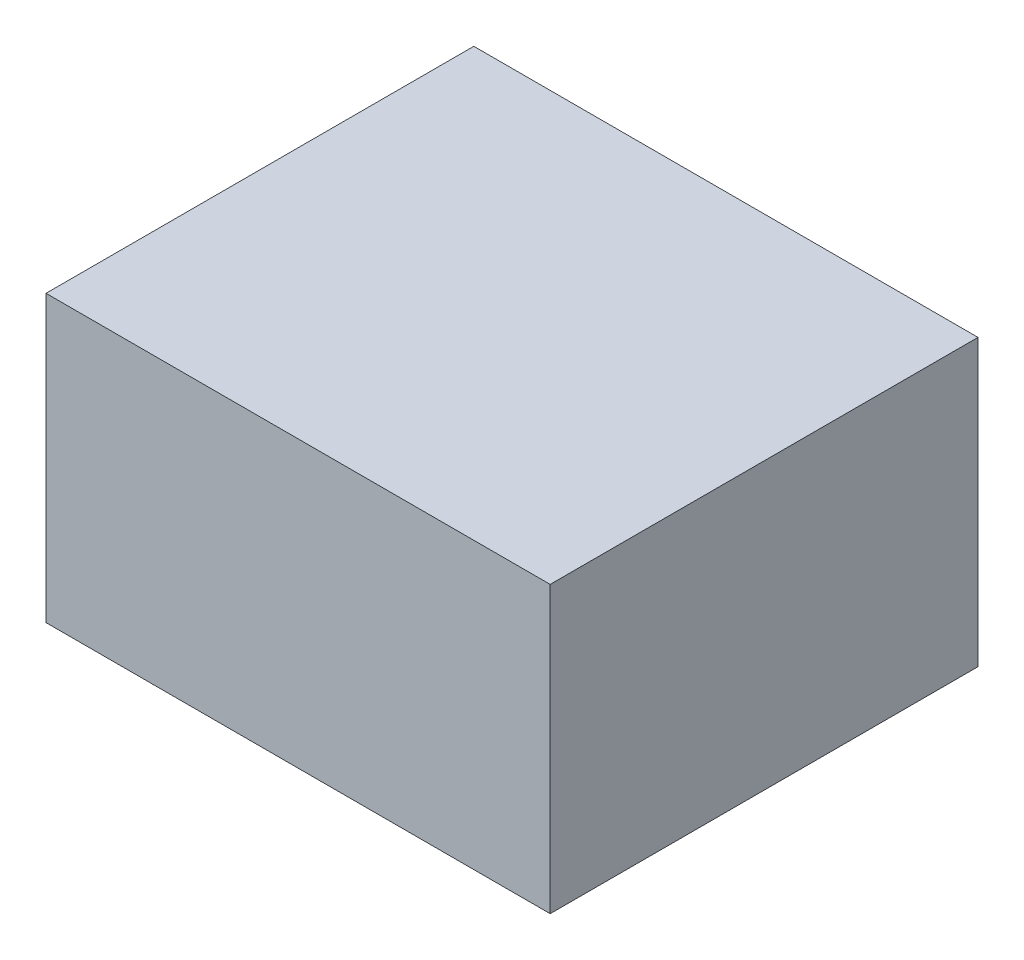
ISO-10303-21;
HEADER;
FILE_DESCRIPTION(('STEP AP214'),'2;1');
FILE_NAME('part.step','',(''),(''),'','','');
FILE_SCHEMA(('AUTOMOTIVE_DESIGN { 1 0 10303 214 1 1 1 1 }'));
ENDSEC;
DATA;
#1=APPLICATION_CONTEXT('core data for automotive mechanical design processes');
#2=APPLICATION_PROTOCOL_DEFINITION('international standard','automotive_design',2000,#1);
#3=PRODUCT_CONTEXT('',#1,'mechanical');
#4=PRODUCT('Part','Part','',(#3));
#5=PRODUCT_RELATED_PRODUCT_CATEGORY('part','',(#4));
#6=PRODUCT_DEFINITION_FORMATION('','',#4);
#7=PRODUCT_DEFINITION_CONTEXT('part definition',#1,'design');
#8=PRODUCT_DEFINITION('design','',#6,#7);
#9=PRODUCT_DEFINITION_SHAPE('','',#8);
#10=(LENGTH_UNIT() NAMED_UNIT(*) SI_UNIT(.MILLI.,.METRE.));
#11=(NAMED_UNIT(*) PLANE_ANGLE_UNIT() SI_UNIT($,.RADIAN.));
#12=(NAMED_UNIT(*) SI_UNIT($,.STERADIAN.) SOLID_ANGLE_UNIT());
#13=UNCERTAINTY_MEASURE_WITH_UNIT(LENGTH_MEASURE(1.E-05),#10,'distance_accuracy_value','');
#14=(GEOMETRIC_REPRESENTATION_CONTEXT(3) GLOBAL_UNCERTAINTY_ASSIGNED_CONTEXT((#13)) GLOBAL_UNIT_ASSIGNED_CONTEXT((#10,
#11,#12)) REPRESENTATION_CONTEXT('',''));
#15=CARTESIAN_POINT('',(0.,0.,0.));
#16=DIRECTION('',(0.,0.,1.));
#17=DIRECTION('',(1.,0.,0.));
#18=AXIS2_PLACEMENT_3D('',#15,#16,#17);
#19=CARTESIAN_POINT('',(0.,0.,4.65));
#20=DIRECTION('',(0.,0.,1.));
#21=DIRECTION('',(1.,0.,0.));
#22=AXIS2_PLACEMENT_3D('',#19,#20,#21);
#23=PLANE('',#22);
#24=DIRECTION('',(1.,0.,0.));
#25=VECTOR('',#24,1.);
#26=CARTESIAN_POINT('',(-2.74,-1.55,4.65));
#27=LINE('',#26,#25);
#28=CARTESIAN_POINT('',(-2.74,-1.55,4.65));
#29=VERTEX_POINT('',#28);
#30=CARTESIAN_POINT('',(2.74,-1.55,4.65));
#31=VERTEX_POINT('',#30);
#32=EDGE_CURVE('E93',#29,#31,#27,.T.);
#33=ORIENTED_EDGE('',*,*,#32,.T.);
#34=DIRECTION('',(0.,1.,0.));
#35=VECTOR('',#34,1.);
#36=CARTESIAN_POINT('',(2.74,-1.55,4.65));
#37=LINE('',#36,#35);
#38=CARTESIAN_POINT('',(2.74,1.55,4.65));
#39=VERTEX_POINT('',#38);
#40=EDGE_CURVE('E73',#31,#39,#37,.T.);
#41=ORIENTED_EDGE('',*,*,#40,.T.);
#42=DIRECTION('',(-1.,0.,0.));
#43=VECTOR('',#42,1.);
#44=CARTESIAN_POINT('',(2.74,1.55,4.65));
#45=LINE('',#44,#43);
#46=CARTESIAN_POINT('',(-2.74,1.55,4.65));
#47=VERTEX_POINT('',#46);
#48=EDGE_CURVE('E20',#39,#47,#45,.T.);
#49=ORIENTED_EDGE('',*,*,#48,.T.);
#50=DIRECTION('',(0.,-1.,0.));
#51=VECTOR('',#50,1.);
#52=CARTESIAN_POINT('',(-2.74,1.55,4.65));
#53=LINE('',#52,#51);
#54=EDGE_CURVE('E11',#47,#29,#53,.T.);
#55=ORIENTED_EDGE('',*,*,#54,.T.);
#56=EDGE_LOOP('',(#33,#41,#49,#55));
#57=FACE_BOUND('',#56,.T.);
#58=ADVANCED_FACE('F17',(#57),#23,.T.);
#59=CARTESIAN_POINT('',(0.,0.,0.));
#60=DIRECTION('',(0.,0.,1.));
#61=DIRECTION('',(1.,0.,0.));
#62=AXIS2_PLACEMENT_3D('',#59,#60,#61);
#63=PLANE('',#62);
#64=DIRECTION('',(0.,-1.,0.));
#65=VECTOR('',#64,1.);
#66=CARTESIAN_POINT('',(-2.74,1.55,0.));
#67=LINE('',#66,#65);
#68=CARTESIAN_POINT('',(-2.74,1.55,0.));
#69=VERTEX_POINT('',#68);
#70=CARTESIAN_POINT('',(-2.74,-1.55,0.));
#71=VERTEX_POINT('',#70);
#72=EDGE_CURVE('E26',#69,#71,#67,.T.);
#73=ORIENTED_EDGE('',*,*,#72,.F.);
#74=DIRECTION('',(-1.,0.,0.));
#75=VECTOR('',#74,1.);
#76=CARTESIAN_POINT('',(2.74,1.55,0.));
#77=LINE('',#76,#75);
#78=CARTESIAN_POINT('',(2.74,1.55,0.));
#79=VERTEX_POINT('',#78);
#80=EDGE_CURVE('E62',#79,#69,#77,.T.);
#81=ORIENTED_EDGE('',*,*,#80,.F.);
#82=DIRECTION('',(0.,1.,0.));
#83=VECTOR('',#82,1.);
#84=CARTESIAN_POINT('',(2.74,-1.55,0.));
#85=LINE('',#84,#83);
#86=CARTESIAN_POINT('',(2.74,-1.55,0.));
#87=VERTEX_POINT('',#86);
#88=EDGE_CURVE('E67',#87,#79,#85,.T.);
#89=ORIENTED_EDGE('',*,*,#88,.F.);
#90=DIRECTION('',(1.,0.,0.));
#91=VECTOR('',#90,1.);
#92=CARTESIAN_POINT('',(-2.74,-1.55,0.));
#93=LINE('',#92,#91);
#94=EDGE_CURVE('E117',#71,#87,#93,.T.);
#95=ORIENTED_EDGE('',*,*,#94,.F.);
#96=EDGE_LOOP('',(#73,#81,#89,#95));
#97=FACE_BOUND('',#96,.T.);
#98=ADVANCED_FACE('F64',(#97),#63,.F.);
#99=CARTESIAN_POINT('',(-2.74,1.55,0.));
#100=DIRECTION('',(1.,0.,0.));
#101=DIRECTION('',(0.,1.,0.));
#102=AXIS2_PLACEMENT_3D('',#99,#100,#101);
#103=PLANE('',#102);
#104=ORIENTED_EDGE('',*,*,#72,.T.);
#105=DIRECTION('',(0.,0.,1.));
#106=VECTOR('',#105,1.);
#107=CARTESIAN_POINT('',(-2.74,-1.55,0.));
#108=LINE('',#107,#106);
#109=EDGE_CURVE('E87',#71,#29,#108,.T.);
#110=ORIENTED_EDGE('',*,*,#109,.T.);
#111=ORIENTED_EDGE('',*,*,#54,.F.);
#112=DIRECTION('',(0.,0.,1.));
#113=VECTOR('',#112,1.);
#114=CARTESIAN_POINT('',(-2.74,1.55,0.));
#115=LINE('',#114,#113);
#116=EDGE_CURVE('E72',#69,#47,#115,.T.);
#117=ORIENTED_EDGE('',*,*,#116,.F.);
#118=EDGE_LOOP('',(#104,#110,#111,#117));
#119=FACE_BOUND('',#118,.T.);
#120=ADVANCED_FACE('F136',(#119),#103,.F.);
#121=CARTESIAN_POINT('',(2.74,1.55,0.));
#122=DIRECTION('',(0.,-1.,0.));
#123=DIRECTION('',(0.,0.,-1.));
#124=AXIS2_PLACEMENT_3D('',#121,#122,#123);
#125=PLANE('',#124);
#126=ORIENTED_EDGE('',*,*,#80,.T.);
#127=ORIENTED_EDGE('',*,*,#116,.T.);
#128=ORIENTED_EDGE('',*,*,#48,.F.);
#129=DIRECTION('',(0.,0.,1.));
#130=VECTOR('',#129,1.);
#131=CARTESIAN_POINT('',(2.74,1.55,0.));
#132=LINE('',#131,#130);
#133=EDGE_CURVE('E75',#79,#39,#132,.T.);
#134=ORIENTED_EDGE('',*,*,#133,.F.);
#135=EDGE_LOOP('',(#126,#127,#128,#134));
#136=FACE_BOUND('',#135,.T.);
#137=ADVANCED_FACE('F76',(#136),#125,.F.);
#138=CARTESIAN_POINT('',(2.74,-1.55,0.));
#139=DIRECTION('',(-1.,0.,0.));
#140=DIRECTION('',(0.,0.,1.));
#141=AXIS2_PLACEMENT_3D('',#138,#139,#140);
#142=PLANE('',#141);
#143=ORIENTED_EDGE('',*,*,#88,.T.);
#144=ORIENTED_EDGE('',*,*,#133,.T.);
#145=ORIENTED_EDGE('',*,*,#40,.F.);
#146=DIRECTION('',(0.,0.,1.));
#147=VECTOR('',#146,1.);
#148=CARTESIAN_POINT('',(2.74,-1.55,0.));
#149=LINE('',#148,#147);
#150=EDGE_CURVE('E84',#87,#31,#149,.T.);
#151=ORIENTED_EDGE('',*,*,#150,.F.);
#152=EDGE_LOOP('',(#143,#144,#145,#151));
#153=FACE_BOUND('',#152,.T.);
#154=ADVANCED_FACE('F82',(#153),#142,.F.);
#155=CARTESIAN_POINT('',(-2.74,-1.55,0.));
#156=DIRECTION('',(0.,1.,0.));
#157=DIRECTION('',(1.,0.,0.));
#158=AXIS2_PLACEMENT_3D('',#155,#156,#157);
#159=PLANE('',#158);
#160=ORIENTED_EDGE('',*,*,#94,.T.);
#161=ORIENTED_EDGE('',*,*,#150,.T.);
#162=ORIENTED_EDGE('',*,*,#32,.F.);
#163=ORIENTED_EDGE('',*,*,#109,.F.);
#164=EDGE_LOOP('',(#160,#161,#162,#163));
#165=FACE_BOUND('',#164,.T.);
#166=ADVANCED_FACE('F122',(#165),#159,.F.);
#167=CLOSED_SHELL('',(#58,#98,#120,#137,#154,#166));
#168=MANIFOLD_SOLID_BREP('B1',#167);
#169=ADVANCED_BREP_SHAPE_REPRESENTATION('',(#18,#168),#14);
#170=SHAPE_DEFINITION_REPRESENTATION(#9,#169);
ENDSEC;
END-ISO-10303-21;
